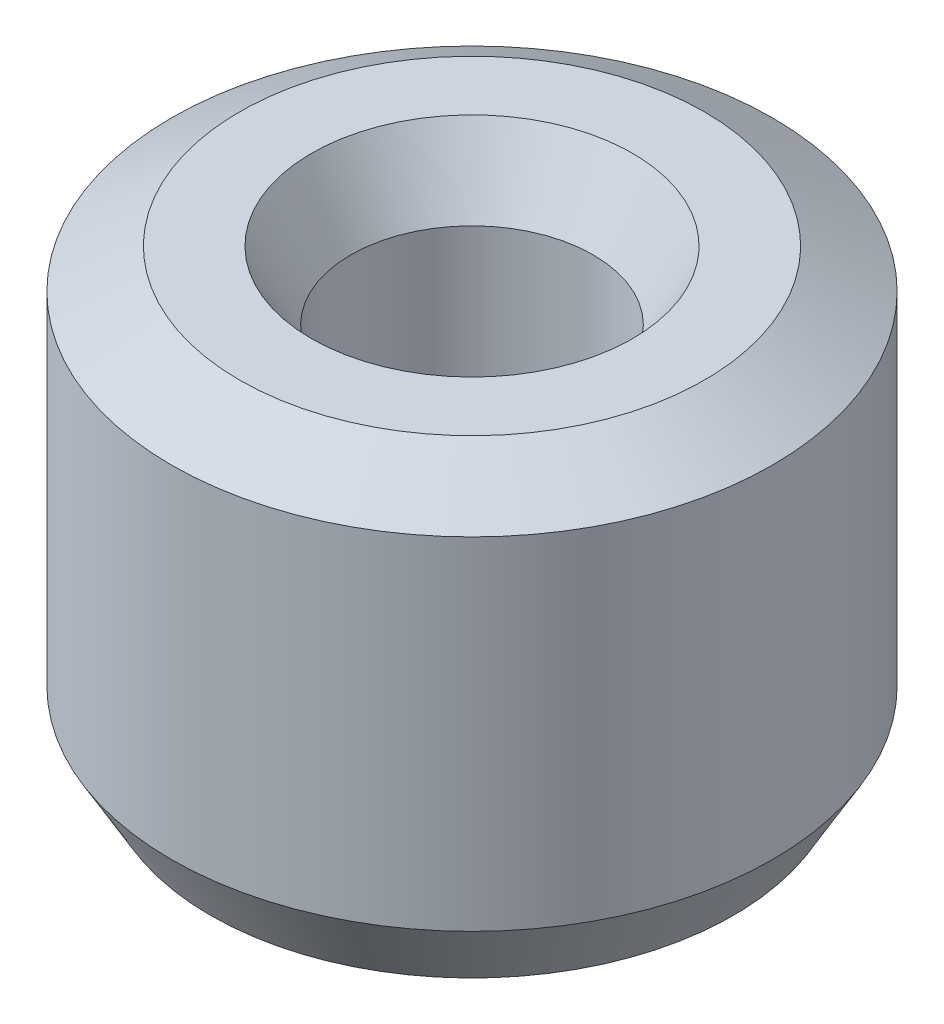
ISO-10303-21;
HEADER;
FILE_DESCRIPTION(('STEP AP214'),'2;1');
FILE_NAME('part.step','',(''),(''),'','','');
FILE_SCHEMA(('AUTOMOTIVE_DESIGN { 1 0 10303 214 1 1 1 1 }'));
ENDSEC;
DATA;
#1=APPLICATION_CONTEXT('core data for automotive mechanical design processes');
#2=APPLICATION_PROTOCOL_DEFINITION('international standard','automotive_design',2000,#1);
#3=PRODUCT_CONTEXT('',#1,'mechanical');
#4=PRODUCT('Part','Part','',(#3));
#5=PRODUCT_RELATED_PRODUCT_CATEGORY('part','',(#4));
#6=PRODUCT_DEFINITION_FORMATION('','',#4);
#7=PRODUCT_DEFINITION_CONTEXT('part definition',#1,'design');
#8=PRODUCT_DEFINITION('design','',#6,#7);
#9=PRODUCT_DEFINITION_SHAPE('','',#8);
#10=(LENGTH_UNIT() NAMED_UNIT(*) SI_UNIT(.MILLI.,.METRE.));
#11=(NAMED_UNIT(*) PLANE_ANGLE_UNIT() SI_UNIT($,.RADIAN.));
#12=(NAMED_UNIT(*) SI_UNIT($,.STERADIAN.) SOLID_ANGLE_UNIT());
#13=UNCERTAINTY_MEASURE_WITH_UNIT(LENGTH_MEASURE(1.E-05),#10,'distance_accuracy_value','');
#14=(GEOMETRIC_REPRESENTATION_CONTEXT(3) GLOBAL_UNCERTAINTY_ASSIGNED_CONTEXT((#13)) GLOBAL_UNIT_ASSIGNED_CONTEXT((#10,
#11,#12)) REPRESENTATION_CONTEXT('',''));
#15=CARTESIAN_POINT('',(0.,0.,0.));
#16=DIRECTION('',(0.,0.,1.));
#17=DIRECTION('',(1.,0.,0.));
#18=AXIS2_PLACEMENT_3D('',#15,#16,#17);
#19=CARTESIAN_POINT('',(0.,26.152556262901,0.));
#20=DIRECTION('',(0.,-1.,0.));
#21=DIRECTION('',(0.,0.,-1.));
#22=AXIS2_PLACEMENT_3D('',#19,#20,#21);
#23=CYLINDRICAL_SURFACE('',#22,17.5);
#24=CARTESIAN_POINT('',(0.,3.97199373124514,0.));
#25=DIRECTION('',(0.,1.,0.));
#26=DIRECTION('',(0.,0.,1.));
#27=AXIS2_PLACEMENT_3D('',#24,#25,#26);
#28=CIRCLE('',#27,17.5);
#29=CARTESIAN_POINT('',(0.,3.97199373124514,17.5));
#30=VERTEX_POINT('',#29);
#31=EDGE_CURVE('E10',#30,#30,#28,.T.);
#32=ORIENTED_EDGE('',*,*,#31,.T.);
#33=EDGE_LOOP('',(#32));
#34=FACE_BOUND('',#33,.T.);
#35=CARTESIAN_POINT('',(0.,23.8593246129471,0.));
#36=DIRECTION('',(0.,1.,0.));
#37=DIRECTION('',(0.,0.,1.));
#38=AXIS2_PLACEMENT_3D('',#35,#36,#37);
#39=CIRCLE('',#38,17.5);
#40=CARTESIAN_POINT('',(0.,23.8593246129471,17.5));
#41=VERTEX_POINT('',#40);
#42=EDGE_CURVE('E50',#41,#41,#39,.F.);
#43=ORIENTED_EDGE('',*,*,#42,.T.);
#44=EDGE_LOOP('',(#43));
#45=FACE_BOUND('',#44,.T.);
#46=ADVANCED_FACE('F39',(#34,#45),#23,.T.);
#47=CARTESIAN_POINT('',(0.,26.152556262901,0.));
#48=DIRECTION('',(0.,1.,0.));
#49=DIRECTION('',(0.,0.,1.));
#50=AXIS2_PLACEMENT_3D('',#47,#48,#49);
#51=PLANE('',#50);
#52=CARTESIAN_POINT('',(0.,26.152556262901,0.));
#53=DIRECTION('',(0.,1.,0.));
#54=DIRECTION('',(0.,0.,1.));
#55=AXIS2_PLACEMENT_3D('',#52,#53,#54);
#56=CIRCLE('',#55,9.34690872456795);
#57=CARTESIAN_POINT('',(0.,26.152556262901,9.34690872456795));
#58=VERTEX_POINT('',#57);
#59=EDGE_CURVE('E58',#58,#58,#56,.F.);
#60=ORIENTED_EDGE('',*,*,#59,.T.);
#61=EDGE_LOOP('',(#60));
#62=FACE_BOUND('',#61,.T.);
#63=CARTESIAN_POINT('',(0.,26.152556262901,0.));
#64=DIRECTION('',(0.,1.,0.));
#65=DIRECTION('',(0.,0.,1.));
#66=AXIS2_PLACEMENT_3D('',#63,#64,#65);
#67=CIRCLE('',#66,13.5280062687549);
#68=CARTESIAN_POINT('',(0.,26.152556262901,13.5280062687549));
#69=VERTEX_POINT('',#68);
#70=EDGE_CURVE('E61',#69,#69,#67,.T.);
#71=ORIENTED_EDGE('',*,*,#70,.T.);
#72=EDGE_LOOP('',(#71));
#73=FACE_BOUND('',#72,.T.);
#74=ADVANCED_FACE('F88',(#62,#73),#51,.T.);
#75=CARTESIAN_POINT('',(0.,0.,0.));
#76=DIRECTION('',(0.,1.,0.));
#77=DIRECTION('',(0.,0.,1.));
#78=AXIS2_PLACEMENT_3D('',#75,#76,#77);
#79=PLANE('',#78);
#80=CARTESIAN_POINT('',(0.,0.,0.));
#81=DIRECTION('',(0.,1.,0.));
#82=DIRECTION('',(0.,0.,1.));
#83=AXIS2_PLACEMENT_3D('',#80,#81,#82);
#84=CIRCLE('',#83,11.0256708058592);
#85=CARTESIAN_POINT('',(0.,0.,11.0256708058592));
#86=VERTEX_POINT('',#85);
#87=EDGE_CURVE('E51',#86,#86,#84,.T.);
#88=ORIENTED_EDGE('',*,*,#87,.T.);
#89=EDGE_LOOP('',(#88));
#90=FACE_BOUND('',#89,.T.);
#91=CARTESIAN_POINT('',(0.,0.,0.));
#92=DIRECTION('',(0.,1.,0.));
#93=DIRECTION('',(0.,0.,1.));
#94=AXIS2_PLACEMENT_3D('',#91,#92,#93);
#95=CIRCLE('',#94,15.2067683500461);
#96=CARTESIAN_POINT('',(0.,0.,15.2067683500461));
#97=VERTEX_POINT('',#96);
#98=EDGE_CURVE('E54',#97,#97,#95,.F.);
#99=ORIENTED_EDGE('',*,*,#98,.T.);
#100=EDGE_LOOP('',(#99));
#101=FACE_BOUND('',#100,.T.);
#102=ADVANCED_FACE('F83',(#90,#101),#79,.F.);
#103=CARTESIAN_POINT('',(0.,26.152556262901,0.));
#104=DIRECTION('',(0.,-1.,0.));
#105=DIRECTION('',(0.,0.,-1.));
#106=AXIS2_PLACEMENT_3D('',#103,#104,#105);
#107=CYLINDRICAL_SURFACE('',#106,7.05367707461405);
#108=CARTESIAN_POINT('',(0.,22.1805625316559,0.));
#109=DIRECTION('',(0.,1.,0.));
#110=DIRECTION('',(0.,0.,1.));
#111=AXIS2_PLACEMENT_3D('',#108,#109,#110);
#112=CIRCLE('',#111,7.05367707461405);
#113=CARTESIAN_POINT('',(0.,22.1805625316559,7.05367707461405));
#114=VERTEX_POINT('',#113);
#115=EDGE_CURVE('E67',#114,#114,#112,.T.);
#116=ORIENTED_EDGE('',*,*,#115,.T.);
#117=EDGE_LOOP('',(#116));
#118=FACE_BOUND('',#117,.T.);
#119=CARTESIAN_POINT('',(0.,2.29323164995391,0.));
#120=DIRECTION('',(0.,1.,0.));
#121=DIRECTION('',(0.,0.,1.));
#122=AXIS2_PLACEMENT_3D('',#119,#120,#121);
#123=CIRCLE('',#122,7.05367707461405);
#124=CARTESIAN_POINT('',(0.,2.29323164995391,7.05367707461405));
#125=VERTEX_POINT('',#124);
#126=EDGE_CURVE('E69',#125,#125,#123,.F.);
#127=ORIENTED_EDGE('',*,*,#126,.T.);
#128=EDGE_LOOP('',(#127));
#129=FACE_BOUND('',#128,.T.);
#130=ADVANCED_FACE('F71',(#118,#129),#107,.F.);
#131=CARTESIAN_POINT('',(0.,22.1805625316559,0.));
#132=DIRECTION('',(0.,1.,0.));
#133=DIRECTION('',(0.,0.,1.));
#134=AXIS2_PLACEMENT_3D('',#131,#132,#133);
#135=CONICAL_SURFACE('',#134,7.05367707461405,0.523598775598302);
#136=ORIENTED_EDGE('',*,*,#59,.F.);
#137=EDGE_LOOP('',(#136));
#138=FACE_BOUND('',#137,.T.);
#139=ORIENTED_EDGE('',*,*,#115,.F.);
#140=EDGE_LOOP('',(#139));
#141=FACE_BOUND('',#140,.T.);
#142=ADVANCED_FACE('F77',(#138,#141),#135,.F.);
#143=CARTESIAN_POINT('',(0.,0.,0.));
#144=DIRECTION('',(0.,-1.,0.));
#145=DIRECTION('',(0.,0.,-1.));
#146=AXIS2_PLACEMENT_3D('',#143,#144,#145);
#147=CONICAL_SURFACE('',#146,11.0256708058592,1.04719755119659);
#148=ORIENTED_EDGE('',*,*,#126,.F.);
#149=EDGE_LOOP('',(#148));
#150=FACE_BOUND('',#149,.T.);
#151=ORIENTED_EDGE('',*,*,#87,.F.);
#152=EDGE_LOOP('',(#151));
#153=FACE_BOUND('',#152,.T.);
#154=ADVANCED_FACE('F73',(#150,#153),#147,.F.);
#155=CARTESIAN_POINT('',(0.,3.97199373124514,0.));
#156=DIRECTION('',(0.,1.,0.));
#157=DIRECTION('',(0.,0.,1.));
#158=AXIS2_PLACEMENT_3D('',#155,#156,#157);
#159=CONICAL_SURFACE('',#158,17.5,0.523598775598302);
#160=ORIENTED_EDGE('',*,*,#98,.F.);
#161=EDGE_LOOP('',(#160));
#162=FACE_BOUND('',#161,.T.);
#163=ORIENTED_EDGE('',*,*,#31,.F.);
#164=EDGE_LOOP('',(#163));
#165=FACE_BOUND('',#164,.T.);
#166=ADVANCED_FACE('F76',(#162,#165),#159,.T.);
#167=CARTESIAN_POINT('',(0.,26.152556262901,0.));
#168=DIRECTION('',(0.,-1.,0.));
#169=DIRECTION('',(0.,0.,-1.));
#170=AXIS2_PLACEMENT_3D('',#167,#168,#169);
#171=CONICAL_SURFACE('',#170,13.5280062687549,1.04719755119659);
#172=ORIENTED_EDGE('',*,*,#42,.F.);
#173=EDGE_LOOP('',(#172));
#174=FACE_BOUND('',#173,.T.);
#175=ORIENTED_EDGE('',*,*,#70,.F.);
#176=EDGE_LOOP('',(#175));
#177=FACE_BOUND('',#176,.T.);
#178=ADVANCED_FACE('F45',(#174,#177),#171,.T.);
#179=CLOSED_SHELL('',(#46,#74,#102,#130,#142,#154,#166,#178));
#180=MANIFOLD_SOLID_BREP('B2',#179);
#181=ADVANCED_BREP_SHAPE_REPRESENTATION('',(#18,#180),#14);
#182=SHAPE_DEFINITION_REPRESENTATION(#9,#181);
ENDSEC;
END-ISO-10303-21;
